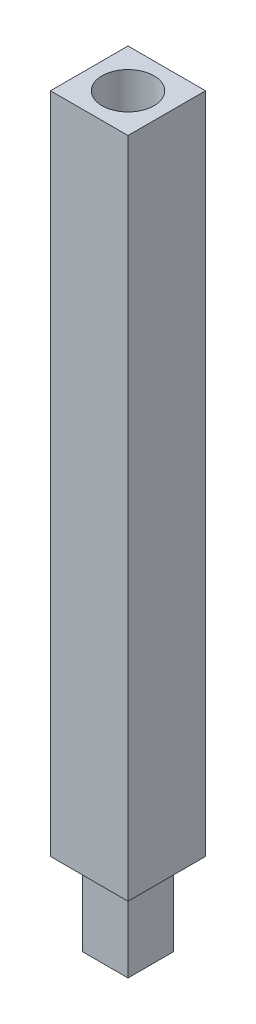
ISO-10303-21;
HEADER;
FILE_DESCRIPTION(('STEP AP214'),'2;1');
FILE_NAME('part.step','',(''),(''),'','','');
FILE_SCHEMA(('AUTOMOTIVE_DESIGN { 1 0 10303 214 1 1 1 1 }'));
ENDSEC;
DATA;
#1=APPLICATION_CONTEXT('core data for automotive mechanical design processes');
#2=APPLICATION_PROTOCOL_DEFINITION('international standard','automotive_design',2000,#1);
#3=PRODUCT_CONTEXT('',#1,'mechanical');
#4=PRODUCT('Part','Part','',(#3));
#5=PRODUCT_RELATED_PRODUCT_CATEGORY('part','',(#4));
#6=PRODUCT_DEFINITION_FORMATION('','',#4);
#7=PRODUCT_DEFINITION_CONTEXT('part definition',#1,'design');
#8=PRODUCT_DEFINITION('design','',#6,#7);
#9=PRODUCT_DEFINITION_SHAPE('','',#8);
#10=(LENGTH_UNIT() NAMED_UNIT(*) SI_UNIT(.MILLI.,.METRE.));
#11=(NAMED_UNIT(*) PLANE_ANGLE_UNIT() SI_UNIT($,.RADIAN.));
#12=(NAMED_UNIT(*) SI_UNIT($,.STERADIAN.) SOLID_ANGLE_UNIT());
#13=UNCERTAINTY_MEASURE_WITH_UNIT(LENGTH_MEASURE(1.E-05),#10,'distance_accuracy_value','');
#14=(GEOMETRIC_REPRESENTATION_CONTEXT(3) GLOBAL_UNCERTAINTY_ASSIGNED_CONTEXT((#13)) GLOBAL_UNIT_ASSIGNED_CONTEXT((#10,
#11,#12)) REPRESENTATION_CONTEXT('',''));
#15=CARTESIAN_POINT('',(0.,0.,0.));
#16=DIRECTION('',(0.,0.,1.));
#17=DIRECTION('',(1.,0.,0.));
#18=AXIS2_PLACEMENT_3D('',#15,#16,#17);
#19=CARTESIAN_POINT('',(0.,110.998,0.));
#20=DIRECTION('',(0.,-1.,0.));
#21=DIRECTION('',(0.,0.,-1.));
#22=AXIS2_PLACEMENT_3D('',#19,#20,#21);
#23=PLANE('',#22);
#24=DIRECTION('',(0.,0.,1.));
#25=VECTOR('',#24,1.);
#26=CARTESIAN_POINT('',(5.969,110.998,-5.969));
#27=LINE('',#26,#25);
#28=CARTESIAN_POINT('',(5.969,110.998,-5.969));
#29=VERTEX_POINT('',#28);
#30=CARTESIAN_POINT('',(5.969,110.998,5.969));
#31=VERTEX_POINT('',#30);
#32=EDGE_CURVE('E55',#29,#31,#27,.T.);
#33=ORIENTED_EDGE('',*,*,#32,.T.);
#34=DIRECTION('',(-1.,0.,0.));
#35=VECTOR('',#34,1.);
#36=CARTESIAN_POINT('',(-5.969,110.998,5.969));
#37=LINE('',#36,#35);
#38=CARTESIAN_POINT('',(-5.969,110.998,5.969));
#39=VERTEX_POINT('',#38);
#40=EDGE_CURVE('E11',#31,#39,#37,.T.);
#41=ORIENTED_EDGE('',*,*,#40,.T.);
#42=DIRECTION('',(0.,0.,-1.));
#43=VECTOR('',#42,1.);
#44=CARTESIAN_POINT('',(-5.969,110.998,-5.969));
#45=LINE('',#44,#43);
#46=CARTESIAN_POINT('',(-5.969,110.998,-5.969));
#47=VERTEX_POINT('',#46);
#48=EDGE_CURVE('E122',#39,#47,#45,.T.);
#49=ORIENTED_EDGE('',*,*,#48,.T.);
#50=DIRECTION('',(1.,0.,0.));
#51=VECTOR('',#50,1.);
#52=CARTESIAN_POINT('',(-5.969,110.998,-5.969));
#53=LINE('',#52,#51);
#54=EDGE_CURVE('E124',#47,#29,#53,.T.);
#55=ORIENTED_EDGE('',*,*,#54,.T.);
#56=EDGE_LOOP('',(#33,#41,#49,#55));
#57=FACE_BOUND('',#56,.T.);
#58=DIRECTION('',(-1.,0.,0.));
#59=VECTOR('',#58,1.);
#60=CARTESIAN_POINT('',(-3.5052,110.998,3.5052));
#61=LINE('',#60,#59);
#62=CARTESIAN_POINT('',(3.5052,110.998,3.5052));
#63=VERTEX_POINT('',#62);
#64=CARTESIAN_POINT('',(-3.5052,110.998,3.5052));
#65=VERTEX_POINT('',#64);
#66=EDGE_CURVE('E209',#63,#65,#61,.T.);
#67=ORIENTED_EDGE('',*,*,#66,.F.);
#68=DIRECTION('',(0.,0.,1.));
#69=VECTOR('',#68,1.);
#70=CARTESIAN_POINT('',(3.5052,110.998,-3.5052));
#71=LINE('',#70,#69);
#72=CARTESIAN_POINT('',(3.5052,110.998,-3.5052));
#73=VERTEX_POINT('',#72);
#74=EDGE_CURVE('E120',#73,#63,#71,.T.);
#75=ORIENTED_EDGE('',*,*,#74,.F.);
#76=DIRECTION('',(1.,0.,0.));
#77=VECTOR('',#76,1.);
#78=CARTESIAN_POINT('',(-3.5052,110.998,-3.5052));
#79=LINE('',#78,#77);
#80=CARTESIAN_POINT('',(-3.5052,110.998,-3.5052));
#81=VERTEX_POINT('',#80);
#82=EDGE_CURVE('E116',#81,#73,#79,.T.);
#83=ORIENTED_EDGE('',*,*,#82,.F.);
#84=DIRECTION('',(0.,0.,-1.));
#85=VECTOR('',#84,1.);
#86=CARTESIAN_POINT('',(-3.5052,110.998,-3.5052));
#87=LINE('',#86,#85);
#88=EDGE_CURVE('E218',#65,#81,#87,.T.);
#89=ORIENTED_EDGE('',*,*,#88,.F.);
#90=EDGE_LOOP('',(#67,#75,#83,#89));
#91=FACE_BOUND('',#90,.T.);
#92=ADVANCED_FACE('F33',(#57,#91),#23,.T.);
#93=CARTESIAN_POINT('',(5.969,213.106,-5.969));
#94=DIRECTION('',(-1.,0.,0.));
#95=DIRECTION('',(0.,0.,1.));
#96=AXIS2_PLACEMENT_3D('',#93,#94,#95);
#97=PLANE('',#96);
#98=ORIENTED_EDGE('',*,*,#32,.F.);
#99=DIRECTION('',(0.,-1.,0.));
#100=VECTOR('',#99,1.);
#101=CARTESIAN_POINT('',(5.969,213.106,-5.969));
#102=LINE('',#101,#100);
#103=CARTESIAN_POINT('',(5.969,213.106,-5.969));
#104=VERTEX_POINT('',#103);
#105=EDGE_CURVE('E41',#104,#29,#102,.T.);
#106=ORIENTED_EDGE('',*,*,#105,.F.);
#107=DIRECTION('',(0.,0.,-1.));
#108=VECTOR('',#107,1.);
#109=CARTESIAN_POINT('',(5.969,213.106,-5.969));
#110=LINE('',#109,#108);
#111=CARTESIAN_POINT('',(5.969,213.106,5.969));
#112=VERTEX_POINT('',#111);
#113=EDGE_CURVE('E131',#112,#104,#110,.T.);
#114=ORIENTED_EDGE('',*,*,#113,.F.);
#115=DIRECTION('',(0.,-1.,0.));
#116=VECTOR('',#115,1.);
#117=CARTESIAN_POINT('',(5.969,213.106,5.969));
#118=LINE('',#117,#116);
#119=EDGE_CURVE('E140',#112,#31,#118,.T.);
#120=ORIENTED_EDGE('',*,*,#119,.T.);
#121=EDGE_LOOP('',(#98,#106,#114,#120));
#122=FACE_BOUND('',#121,.T.);
#123=ADVANCED_FACE('F35',(#122),#97,.F.);
#124=CARTESIAN_POINT('',(-5.969,213.106,-5.969));
#125=DIRECTION('',(0.,0.,1.));
#126=DIRECTION('',(1.,0.,0.));
#127=AXIS2_PLACEMENT_3D('',#124,#125,#126);
#128=PLANE('',#127);
#129=ORIENTED_EDGE('',*,*,#54,.F.);
#130=DIRECTION('',(0.,-1.,0.));
#131=VECTOR('',#130,1.);
#132=CARTESIAN_POINT('',(-5.969,213.106,-5.969));
#133=LINE('',#132,#131);
#134=CARTESIAN_POINT('',(-5.969,213.106,-5.969));
#135=VERTEX_POINT('',#134);
#136=EDGE_CURVE('E146',#135,#47,#133,.T.);
#137=ORIENTED_EDGE('',*,*,#136,.F.);
#138=DIRECTION('',(-1.,0.,0.));
#139=VECTOR('',#138,1.);
#140=CARTESIAN_POINT('',(-5.969,213.106,-5.969));
#141=LINE('',#140,#139);
#142=EDGE_CURVE('E134',#104,#135,#141,.T.);
#143=ORIENTED_EDGE('',*,*,#142,.F.);
#144=ORIENTED_EDGE('',*,*,#105,.T.);
#145=EDGE_LOOP('',(#129,#137,#143,#144));
#146=FACE_BOUND('',#145,.T.);
#147=ADVANCED_FACE('F152',(#146),#128,.F.);
#148=CARTESIAN_POINT('',(-5.969,213.106,-5.969));
#149=DIRECTION('',(1.,0.,0.));
#150=DIRECTION('',(0.,0.,-1.));
#151=AXIS2_PLACEMENT_3D('',#148,#149,#150);
#152=PLANE('',#151);
#153=ORIENTED_EDGE('',*,*,#48,.F.);
#154=DIRECTION('',(0.,-1.,0.));
#155=VECTOR('',#154,1.);
#156=CARTESIAN_POINT('',(-5.969,213.106,5.969));
#157=LINE('',#156,#155);
#158=CARTESIAN_POINT('',(-5.969,213.106,5.969));
#159=VERTEX_POINT('',#158);
#160=EDGE_CURVE('E143',#159,#39,#157,.T.);
#161=ORIENTED_EDGE('',*,*,#160,.F.);
#162=DIRECTION('',(0.,0.,1.));
#163=VECTOR('',#162,1.);
#164=CARTESIAN_POINT('',(-5.969,213.106,-5.969));
#165=LINE('',#164,#163);
#166=EDGE_CURVE('E136',#135,#159,#165,.T.);
#167=ORIENTED_EDGE('',*,*,#166,.F.);
#168=ORIENTED_EDGE('',*,*,#136,.T.);
#169=EDGE_LOOP('',(#153,#161,#167,#168));
#170=FACE_BOUND('',#169,.T.);
#171=ADVANCED_FACE('F164',(#170),#152,.F.);
#172=CARTESIAN_POINT('',(-5.969,213.106,5.969));
#173=DIRECTION('',(0.,0.,-1.));
#174=DIRECTION('',(-1.,0.,0.));
#175=AXIS2_PLACEMENT_3D('',#172,#173,#174);
#176=PLANE('',#175);
#177=ORIENTED_EDGE('',*,*,#40,.F.);
#178=ORIENTED_EDGE('',*,*,#119,.F.);
#179=DIRECTION('',(1.,0.,0.));
#180=VECTOR('',#179,1.);
#181=CARTESIAN_POINT('',(-5.969,213.106,5.969));
#182=LINE('',#181,#180);
#183=EDGE_CURVE('E138',#159,#112,#182,.T.);
#184=ORIENTED_EDGE('',*,*,#183,.F.);
#185=ORIENTED_EDGE('',*,*,#160,.T.);
#186=EDGE_LOOP('',(#177,#178,#184,#185));
#187=FACE_BOUND('',#186,.T.);
#188=ADVANCED_FACE('F159',(#187),#176,.F.);
#189=CARTESIAN_POINT('',(0.,213.106,0.));
#190=DIRECTION('',(0.,1.,0.));
#191=DIRECTION('',(0.,0.,1.));
#192=AXIS2_PLACEMENT_3D('',#189,#190,#191);
#193=PLANE('',#192);
#194=CARTESIAN_POINT('',(0.,213.106,0.));
#195=DIRECTION('',(0.,1.,0.));
#196=DIRECTION('',(0.,0.,1.));
#197=AXIS2_PLACEMENT_3D('',#194,#195,#196);
#198=CIRCLE('',#197,4.0005);
#199=CARTESIAN_POINT('',(0.,213.106,4.0005));
#200=VERTEX_POINT('',#199);
#201=EDGE_CURVE('E207',#200,#200,#198,.T.);
#202=ORIENTED_EDGE('',*,*,#201,.F.);
#203=EDGE_LOOP('',(#202));
#204=FACE_BOUND('',#203,.T.);
#205=ORIENTED_EDGE('',*,*,#113,.T.);
#206=ORIENTED_EDGE('',*,*,#142,.T.);
#207=ORIENTED_EDGE('',*,*,#166,.T.);
#208=ORIENTED_EDGE('',*,*,#183,.T.);
#209=EDGE_LOOP('',(#205,#206,#207,#208));
#210=FACE_BOUND('',#209,.T.);
#211=ADVANCED_FACE('F167',(#204,#210),#193,.T.);
#212=CARTESIAN_POINT('',(3.5052,98.298,-3.5052));
#213=DIRECTION('',(-1.,0.,0.));
#214=DIRECTION('',(0.,0.,1.));
#215=AXIS2_PLACEMENT_3D('',#212,#213,#214);
#216=PLANE('',#215);
#217=ORIENTED_EDGE('',*,*,#74,.T.);
#218=DIRECTION('',(0.,1.,0.));
#219=VECTOR('',#218,1.);
#220=CARTESIAN_POINT('',(3.5052,98.298,3.5052));
#221=LINE('',#220,#219);
#222=CARTESIAN_POINT('',(3.5052,98.298,3.5052));
#223=VERTEX_POINT('',#222);
#224=EDGE_CURVE('E101',#223,#63,#221,.T.);
#225=ORIENTED_EDGE('',*,*,#224,.F.);
#226=DIRECTION('',(0.,0.,1.));
#227=VECTOR('',#226,1.);
#228=CARTESIAN_POINT('',(3.5052,98.298,-3.5052));
#229=LINE('',#228,#227);
#230=CARTESIAN_POINT('',(3.5052,98.298,-3.5052));
#231=VERTEX_POINT('',#230);
#232=EDGE_CURVE('E108',#231,#223,#229,.T.);
#233=ORIENTED_EDGE('',*,*,#232,.F.);
#234=DIRECTION('',(0.,1.,0.));
#235=VECTOR('',#234,1.);
#236=CARTESIAN_POINT('',(3.5052,98.298,-3.5052));
#237=LINE('',#236,#235);
#238=EDGE_CURVE('E215',#231,#73,#237,.T.);
#239=ORIENTED_EDGE('',*,*,#238,.T.);
#240=EDGE_LOOP('',(#217,#225,#233,#239));
#241=FACE_BOUND('',#240,.T.);
#242=ADVANCED_FACE('F118',(#241),#216,.F.);
#243=CARTESIAN_POINT('',(-3.5052,98.298,3.5052));
#244=DIRECTION('',(0.,0.,-1.));
#245=DIRECTION('',(-1.,0.,0.));
#246=AXIS2_PLACEMENT_3D('',#243,#244,#245);
#247=PLANE('',#246);
#248=ORIENTED_EDGE('',*,*,#66,.T.);
#249=DIRECTION('',(0.,1.,0.));
#250=VECTOR('',#249,1.);
#251=CARTESIAN_POINT('',(-3.5052,98.298,3.5052));
#252=LINE('',#251,#250);
#253=CARTESIAN_POINT('',(-3.5052,98.298,3.5052));
#254=VERTEX_POINT('',#253);
#255=EDGE_CURVE('E104',#254,#65,#252,.T.);
#256=ORIENTED_EDGE('',*,*,#255,.F.);
#257=DIRECTION('',(-1.,0.,0.));
#258=VECTOR('',#257,1.);
#259=CARTESIAN_POINT('',(-3.5052,98.298,3.5052));
#260=LINE('',#259,#258);
#261=EDGE_CURVE('E97',#223,#254,#260,.T.);
#262=ORIENTED_EDGE('',*,*,#261,.F.);
#263=ORIENTED_EDGE('',*,*,#224,.T.);
#264=EDGE_LOOP('',(#248,#256,#262,#263));
#265=FACE_BOUND('',#264,.T.);
#266=ADVANCED_FACE('F99',(#265),#247,.F.);
#267=CARTESIAN_POINT('',(-3.5052,98.298,-3.5052));
#268=DIRECTION('',(1.,0.,0.));
#269=DIRECTION('',(0.,0.,-1.));
#270=AXIS2_PLACEMENT_3D('',#267,#268,#269);
#271=PLANE('',#270);
#272=ORIENTED_EDGE('',*,*,#88,.T.);
#273=DIRECTION('',(0.,1.,0.));
#274=VECTOR('',#273,1.);
#275=CARTESIAN_POINT('',(-3.5052,98.298,-3.5052));
#276=LINE('',#275,#274);
#277=CARTESIAN_POINT('',(-3.5052,98.298,-3.5052));
#278=VERTEX_POINT('',#277);
#279=EDGE_CURVE('E48',#278,#81,#276,.T.);
#280=ORIENTED_EDGE('',*,*,#279,.F.);
#281=DIRECTION('',(0.,0.,-1.));
#282=VECTOR('',#281,1.);
#283=CARTESIAN_POINT('',(-3.5052,98.298,-3.5052));
#284=LINE('',#283,#282);
#285=EDGE_CURVE('E107',#254,#278,#284,.T.);
#286=ORIENTED_EDGE('',*,*,#285,.F.);
#287=ORIENTED_EDGE('',*,*,#255,.T.);
#288=EDGE_LOOP('',(#272,#280,#286,#287));
#289=FACE_BOUND('',#288,.T.);
#290=ADVANCED_FACE('F186',(#289),#271,.F.);
#291=CARTESIAN_POINT('',(-3.5052,98.298,-3.5052));
#292=DIRECTION('',(0.,0.,1.));
#293=DIRECTION('',(1.,0.,0.));
#294=AXIS2_PLACEMENT_3D('',#291,#292,#293);
#295=PLANE('',#294);
#296=ORIENTED_EDGE('',*,*,#82,.T.);
#297=ORIENTED_EDGE('',*,*,#238,.F.);
#298=DIRECTION('',(1.,0.,0.));
#299=VECTOR('',#298,1.);
#300=CARTESIAN_POINT('',(-3.5052,98.298,-3.5052));
#301=LINE('',#300,#299);
#302=EDGE_CURVE('E112',#278,#231,#301,.T.);
#303=ORIENTED_EDGE('',*,*,#302,.F.);
#304=ORIENTED_EDGE('',*,*,#279,.T.);
#305=EDGE_LOOP('',(#296,#297,#303,#304));
#306=FACE_BOUND('',#305,.T.);
#307=ADVANCED_FACE('F189',(#306),#295,.F.);
#308=CARTESIAN_POINT('',(0.,98.298,0.));
#309=DIRECTION('',(0.,1.,0.));
#310=DIRECTION('',(0.,0.,1.));
#311=AXIS2_PLACEMENT_3D('',#308,#309,#310);
#312=PLANE('',#311);
#313=ORIENTED_EDGE('',*,*,#232,.T.);
#314=ORIENTED_EDGE('',*,*,#261,.T.);
#315=ORIENTED_EDGE('',*,*,#285,.T.);
#316=ORIENTED_EDGE('',*,*,#302,.T.);
#317=EDGE_LOOP('',(#313,#314,#315,#316));
#318=FACE_BOUND('',#317,.T.);
#319=ADVANCED_FACE('F111',(#318),#312,.F.);
#320=CARTESIAN_POINT('',(0.,201.9935,0.));
#321=DIRECTION('',(0.,1.,0.));
#322=DIRECTION('',(0.,0.,1.));
#323=AXIS2_PLACEMENT_3D('',#320,#321,#322);
#324=CYLINDRICAL_SURFACE('',#323,4.0005);
#325=CARTESIAN_POINT('',(0.,201.9935,0.));
#326=DIRECTION('',(0.,1.,0.));
#327=DIRECTION('',(0.,0.,1.));
#328=AXIS2_PLACEMENT_3D('',#325,#326,#327);
#329=CIRCLE('',#328,4.0005);
#330=CARTESIAN_POINT('',(0.,201.9935,4.0005));
#331=VERTEX_POINT('',#330);
#332=EDGE_CURVE('E206',#331,#331,#329,.T.);
#333=ORIENTED_EDGE('',*,*,#332,.F.);
#334=EDGE_LOOP('',(#333));
#335=FACE_BOUND('',#334,.T.);
#336=ORIENTED_EDGE('',*,*,#201,.T.);
#337=EDGE_LOOP('',(#336));
#338=FACE_BOUND('',#337,.T.);
#339=ADVANCED_FACE('F195',(#335,#338),#324,.F.);
#340=CARTESIAN_POINT('',(0.,201.9935,0.));
#341=DIRECTION('',(0.,1.,0.));
#342=DIRECTION('',(0.,0.,1.));
#343=AXIS2_PLACEMENT_3D('',#340,#341,#342);
#344=PLANE('',#343);
#345=ORIENTED_EDGE('',*,*,#332,.T.);
#346=EDGE_LOOP('',(#345));
#347=FACE_BOUND('',#346,.T.);
#348=ADVANCED_FACE('F198',(#347),#344,.T.);
#349=CLOSED_SHELL('',(#92,#123,#147,#171,#188,#211,#242,#266,#290,#307,#319,#339,#348));
#350=MANIFOLD_SOLID_BREP('B2',#349);
#351=ADVANCED_BREP_SHAPE_REPRESENTATION('',(#18,#350),#14);
#352=SHAPE_DEFINITION_REPRESENTATION(#9,#351);
ENDSEC;
END-ISO-10303-21;
